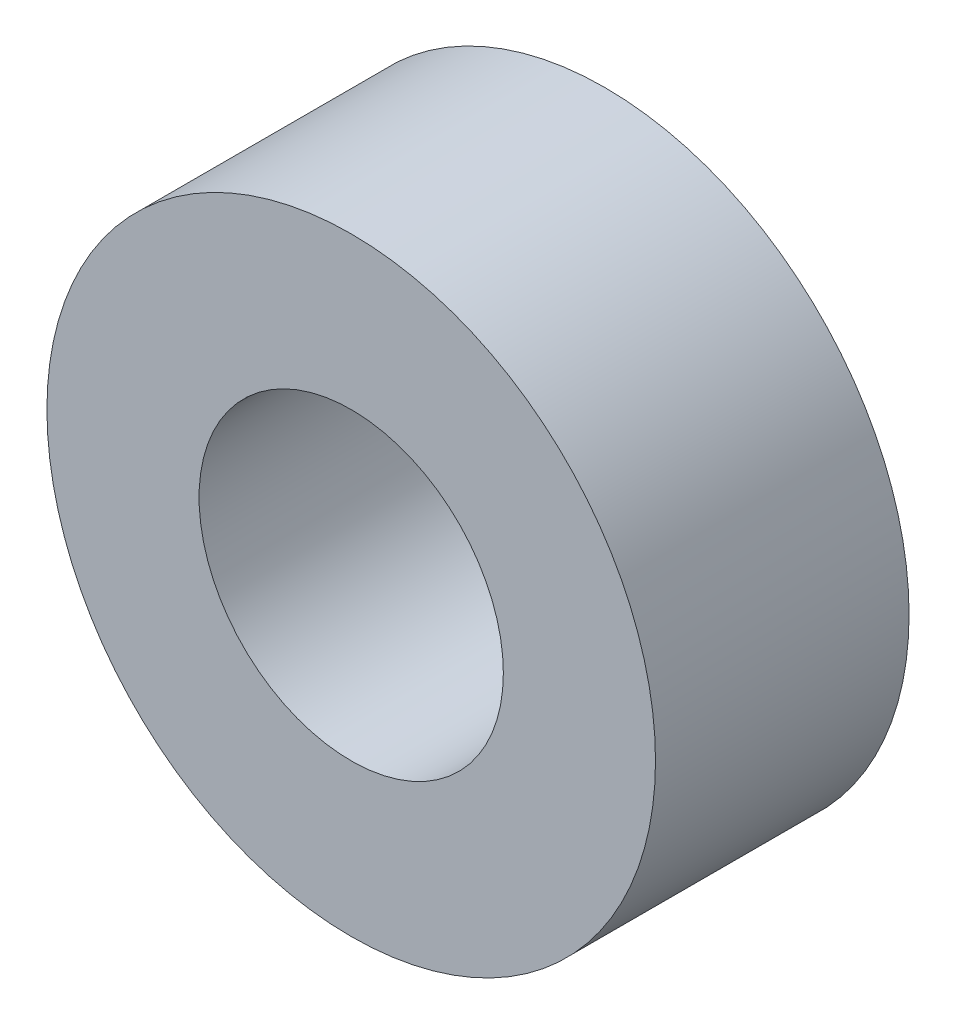
ISO-10303-21;
HEADER;
FILE_DESCRIPTION(('STEP AP214'),'2;1');
FILE_NAME('part.step','',(''),(''),'','','');
FILE_SCHEMA(('AUTOMOTIVE_DESIGN { 1 0 10303 214 1 1 1 1 }'));
ENDSEC;
DATA;
#1=APPLICATION_CONTEXT('core data for automotive mechanical design processes');
#2=APPLICATION_PROTOCOL_DEFINITION('international standard','automotive_design',2000,#1);
#3=PRODUCT_CONTEXT('',#1,'mechanical');
#4=PRODUCT('Part','Part','',(#3));
#5=PRODUCT_RELATED_PRODUCT_CATEGORY('part','',(#4));
#6=PRODUCT_DEFINITION_FORMATION('','',#4);
#7=PRODUCT_DEFINITION_CONTEXT('part definition',#1,'design');
#8=PRODUCT_DEFINITION('design','',#6,#7);
#9=PRODUCT_DEFINITION_SHAPE('','',#8);
#10=(LENGTH_UNIT() NAMED_UNIT(*) SI_UNIT(.MILLI.,.METRE.));
#11=(NAMED_UNIT(*) PLANE_ANGLE_UNIT() SI_UNIT($,.RADIAN.));
#12=(NAMED_UNIT(*) SI_UNIT($,.STERADIAN.) SOLID_ANGLE_UNIT());
#13=UNCERTAINTY_MEASURE_WITH_UNIT(LENGTH_MEASURE(1.E-05),#10,'distance_accuracy_value','');
#14=(GEOMETRIC_REPRESENTATION_CONTEXT(3) GLOBAL_UNCERTAINTY_ASSIGNED_CONTEXT((#13)) GLOBAL_UNIT_ASSIGNED_CONTEXT((#10,
#11,#12)) REPRESENTATION_CONTEXT('',''));
#15=CARTESIAN_POINT('',(0.,0.,0.));
#16=DIRECTION('',(0.,0.,1.));
#17=DIRECTION('',(1.,0.,0.));
#18=AXIS2_PLACEMENT_3D('',#15,#16,#17);
#19=CARTESIAN_POINT('',(0.,0.,2.5));
#20=DIRECTION('',(0.,0.,1.));
#21=DIRECTION('',(1.,0.,0.));
#22=AXIS2_PLACEMENT_3D('',#19,#20,#21);
#23=PLANE('',#22);
#24=CARTESIAN_POINT('',(0.,0.,2.5));
#25=DIRECTION('',(0.,0.,1.));
#26=DIRECTION('',(1.,0.,0.));
#27=AXIS2_PLACEMENT_3D('',#24,#25,#26);
#28=CIRCLE('',#27,3.);
#29=CARTESIAN_POINT('',(3.,0.,2.5));
#30=VERTEX_POINT('',#29);
#31=EDGE_CURVE('E10',#30,#30,#28,.T.);
#32=ORIENTED_EDGE('',*,*,#31,.T.);
#33=EDGE_LOOP('',(#32));
#34=FACE_BOUND('',#33,.T.);
#35=CARTESIAN_POINT('',(0.,0.,2.5));
#36=DIRECTION('',(0.,0.,1.));
#37=DIRECTION('',(1.,0.,0.));
#38=AXIS2_PLACEMENT_3D('',#35,#36,#37);
#39=CIRCLE('',#38,1.5);
#40=CARTESIAN_POINT('',(1.5,0.,2.5));
#41=VERTEX_POINT('',#40);
#42=EDGE_CURVE('E54',#41,#41,#39,.T.);
#43=ORIENTED_EDGE('',*,*,#42,.F.);
#44=EDGE_LOOP('',(#43));
#45=FACE_BOUND('',#44,.T.);
#46=ADVANCED_FACE('F41',(#34,#45),#23,.T.);
#47=CARTESIAN_POINT('',(0.,0.,0.));
#48=DIRECTION('',(0.,0.,1.));
#49=DIRECTION('',(1.,0.,0.));
#50=AXIS2_PLACEMENT_3D('',#47,#48,#49);
#51=PLANE('',#50);
#52=CARTESIAN_POINT('',(0.,0.,0.));
#53=DIRECTION('',(0.,0.,1.));
#54=DIRECTION('',(1.,0.,0.));
#55=AXIS2_PLACEMENT_3D('',#52,#53,#54);
#56=CIRCLE('',#55,3.);
#57=CARTESIAN_POINT('',(3.,0.,0.));
#58=VERTEX_POINT('',#57);
#59=EDGE_CURVE('E45',#58,#58,#56,.T.);
#60=ORIENTED_EDGE('',*,*,#59,.F.);
#61=EDGE_LOOP('',(#60));
#62=FACE_BOUND('',#61,.T.);
#63=CARTESIAN_POINT('',(0.,0.,0.));
#64=DIRECTION('',(0.,0.,1.));
#65=DIRECTION('',(1.,0.,0.));
#66=AXIS2_PLACEMENT_3D('',#63,#64,#65);
#67=CIRCLE('',#66,1.5);
#68=CARTESIAN_POINT('',(1.5,0.,0.));
#69=VERTEX_POINT('',#68);
#70=EDGE_CURVE('E56',#69,#69,#67,.T.);
#71=ORIENTED_EDGE('',*,*,#70,.T.);
#72=EDGE_LOOP('',(#71));
#73=FACE_BOUND('',#72,.T.);
#74=ADVANCED_FACE('F68',(#62,#73),#51,.F.);
#75=CARTESIAN_POINT('',(0.,0.,2.5));
#76=DIRECTION('',(0.,0.,-1.));
#77=DIRECTION('',(-1.,0.,0.));
#78=AXIS2_PLACEMENT_3D('',#75,#76,#77);
#79=CYLINDRICAL_SURFACE('',#78,3.);
#80=ORIENTED_EDGE('',*,*,#31,.F.);
#81=EDGE_LOOP('',(#80));
#82=FACE_BOUND('',#81,.T.);
#83=ORIENTED_EDGE('',*,*,#59,.T.);
#84=EDGE_LOOP('',(#83));
#85=FACE_BOUND('',#84,.T.);
#86=ADVANCED_FACE('F43',(#82,#85),#79,.T.);
#87=CARTESIAN_POINT('',(0.,0.,2.5));
#88=DIRECTION('',(0.,0.,-1.));
#89=DIRECTION('',(-1.,0.,0.));
#90=AXIS2_PLACEMENT_3D('',#87,#88,#89);
#91=CYLINDRICAL_SURFACE('',#90,1.5);
#92=ORIENTED_EDGE('',*,*,#42,.T.);
#93=EDGE_LOOP('',(#92));
#94=FACE_BOUND('',#93,.T.);
#95=ORIENTED_EDGE('',*,*,#70,.F.);
#96=EDGE_LOOP('',(#95));
#97=FACE_BOUND('',#96,.T.);
#98=ADVANCED_FACE('F64',(#94,#97),#91,.F.);
#99=CLOSED_SHELL('',(#46,#74,#86,#98));
#100=MANIFOLD_SOLID_BREP('B2',#99);
#101=ADVANCED_BREP_SHAPE_REPRESENTATION('',(#18,#100),#14);
#102=SHAPE_DEFINITION_REPRESENTATION(#9,#101);
ENDSEC;
END-ISO-10303-21;
